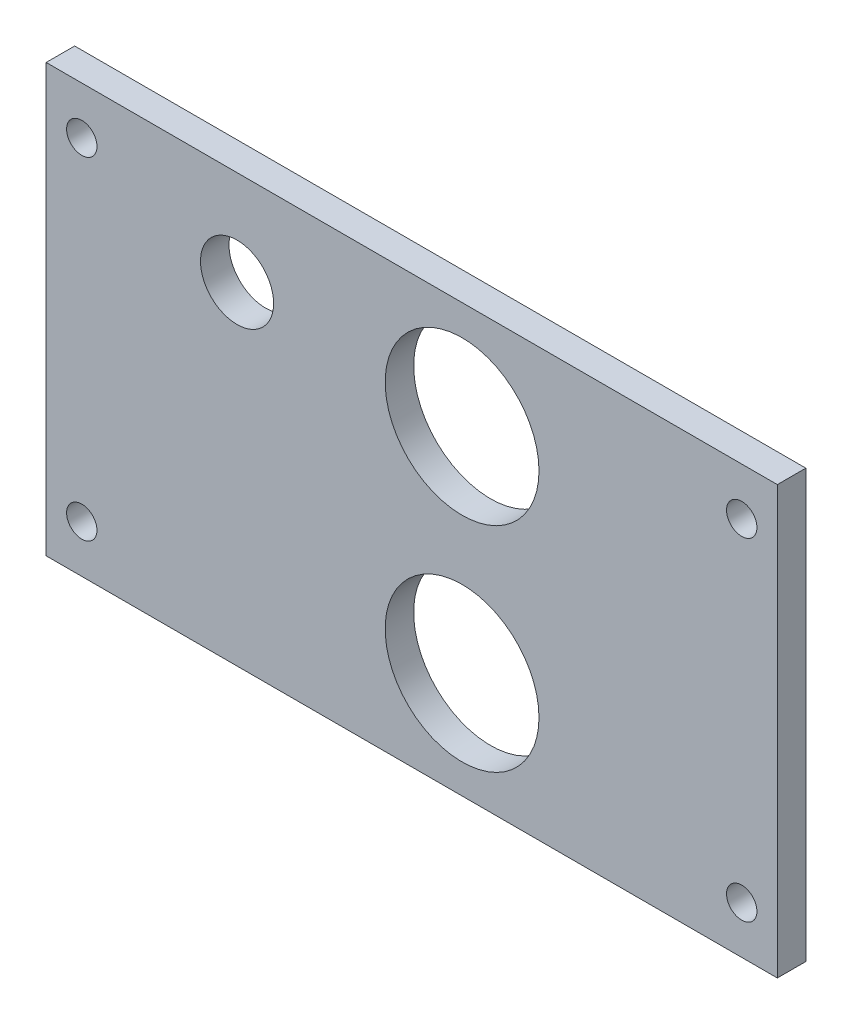
ISO-10303-21;
HEADER;
FILE_DESCRIPTION(('STEP AP214'),'2;1');
FILE_NAME('part.step','',(''),(''),'','','');
FILE_SCHEMA(('AUTOMOTIVE_DESIGN { 1 0 10303 214 1 1 1 1 }'));
ENDSEC;
DATA;
#1=APPLICATION_CONTEXT('core data for automotive mechanical design processes');
#2=APPLICATION_PROTOCOL_DEFINITION('international standard','automotive_design',2000,#1);
#3=PRODUCT_CONTEXT('',#1,'mechanical');
#4=PRODUCT('Part','Part','',(#3));
#5=PRODUCT_RELATED_PRODUCT_CATEGORY('part','',(#4));
#6=PRODUCT_DEFINITION_FORMATION('','',#4);
#7=PRODUCT_DEFINITION_CONTEXT('part definition',#1,'design');
#8=PRODUCT_DEFINITION('design','',#6,#7);
#9=PRODUCT_DEFINITION_SHAPE('','',#8);
#10=(LENGTH_UNIT() NAMED_UNIT(*) SI_UNIT(.MILLI.,.METRE.));
#11=(NAMED_UNIT(*) PLANE_ANGLE_UNIT() SI_UNIT($,.RADIAN.));
#12=(NAMED_UNIT(*) SI_UNIT($,.STERADIAN.) SOLID_ANGLE_UNIT());
#13=UNCERTAINTY_MEASURE_WITH_UNIT(LENGTH_MEASURE(1.E-05),#10,'distance_accuracy_value','');
#14=(GEOMETRIC_REPRESENTATION_CONTEXT(3) GLOBAL_UNCERTAINTY_ASSIGNED_CONTEXT((#13)) GLOBAL_UNIT_ASSIGNED_CONTEXT((#10,
#11,#12)) REPRESENTATION_CONTEXT('',''));
#15=CARTESIAN_POINT('',(0.,0.,0.));
#16=DIRECTION('',(0.,0.,1.));
#17=DIRECTION('',(1.,0.,0.));
#18=AXIS2_PLACEMENT_3D('',#15,#16,#17);
#19=CARTESIAN_POINT('',(-38.5,-22.5,3.));
#20=DIRECTION('',(1.,0.,0.));
#21=DIRECTION('',(0.,0.,-1.));
#22=AXIS2_PLACEMENT_3D('',#19,#20,#21);
#23=PLANE('',#22);
#24=DIRECTION('',(0.,-1.,0.));
#25=VECTOR('',#24,1.);
#26=CARTESIAN_POINT('',(-38.5,-22.5,0.));
#27=LINE('',#26,#25);
#28=CARTESIAN_POINT('',(-38.5,22.5,0.));
#29=VERTEX_POINT('',#28);
#30=CARTESIAN_POINT('',(-38.5,-22.5,0.));
#31=VERTEX_POINT('',#30);
#32=EDGE_CURVE('E93',#29,#31,#27,.T.);
#33=ORIENTED_EDGE('',*,*,#32,.T.);
#34=DIRECTION('',(0.,0.,-1.));
#35=VECTOR('',#34,1.);
#36=CARTESIAN_POINT('',(-38.5,-22.5,3.));
#37=LINE('',#36,#35);
#38=CARTESIAN_POINT('',(-38.5,-22.5,3.));
#39=VERTEX_POINT('',#38);
#40=EDGE_CURVE('E11',#39,#31,#37,.T.);
#41=ORIENTED_EDGE('',*,*,#40,.F.);
#42=DIRECTION('',(0.,-1.,0.));
#43=VECTOR('',#42,1.);
#44=CARTESIAN_POINT('',(-38.5,-22.5,3.));
#45=LINE('',#44,#43);
#46=CARTESIAN_POINT('',(-38.5,22.5,3.));
#47=VERTEX_POINT('',#46);
#48=EDGE_CURVE('E81',#47,#39,#45,.T.);
#49=ORIENTED_EDGE('',*,*,#48,.F.);
#50=DIRECTION('',(0.,0.,-1.));
#51=VECTOR('',#50,1.);
#52=CARTESIAN_POINT('',(-38.5,22.5,3.));
#53=LINE('',#52,#51);
#54=EDGE_CURVE('E89',#47,#29,#53,.T.);
#55=ORIENTED_EDGE('',*,*,#54,.T.);
#56=EDGE_LOOP('',(#33,#41,#49,#55));
#57=FACE_BOUND('',#56,.T.);
#58=ADVANCED_FACE('F30',(#57),#23,.F.);
#59=CARTESIAN_POINT('',(38.5,-22.5,3.));
#60=DIRECTION('',(0.,1.,0.));
#61=DIRECTION('',(-1.,0.,0.));
#62=AXIS2_PLACEMENT_3D('',#59,#60,#61);
#63=PLANE('',#62);
#64=DIRECTION('',(1.,0.,0.));
#65=VECTOR('',#64,1.);
#66=CARTESIAN_POINT('',(38.5,-22.5,0.));
#67=LINE('',#66,#65);
#68=CARTESIAN_POINT('',(38.5,-22.5,0.));
#69=VERTEX_POINT('',#68);
#70=EDGE_CURVE('E85',#31,#69,#67,.T.);
#71=ORIENTED_EDGE('',*,*,#70,.T.);
#72=DIRECTION('',(0.,0.,-1.));
#73=VECTOR('',#72,1.);
#74=CARTESIAN_POINT('',(38.5,-22.5,3.));
#75=LINE('',#74,#73);
#76=CARTESIAN_POINT('',(38.5,-22.5,3.));
#77=VERTEX_POINT('',#76);
#78=EDGE_CURVE('E38',#77,#69,#75,.T.);
#79=ORIENTED_EDGE('',*,*,#78,.F.);
#80=DIRECTION('',(1.,0.,0.));
#81=VECTOR('',#80,1.);
#82=CARTESIAN_POINT('',(38.5,-22.5,3.));
#83=LINE('',#82,#81);
#84=EDGE_CURVE('E76',#39,#77,#83,.T.);
#85=ORIENTED_EDGE('',*,*,#84,.F.);
#86=ORIENTED_EDGE('',*,*,#40,.T.);
#87=EDGE_LOOP('',(#71,#79,#85,#86));
#88=FACE_BOUND('',#87,.T.);
#89=ADVANCED_FACE('F84',(#88),#63,.F.);
#90=CARTESIAN_POINT('',(38.5,-22.5,3.));
#91=DIRECTION('',(-1.,0.,0.));
#92=DIRECTION('',(0.,0.,1.));
#93=AXIS2_PLACEMENT_3D('',#90,#91,#92);
#94=PLANE('',#93);
#95=DIRECTION('',(0.,1.,0.));
#96=VECTOR('',#95,1.);
#97=CARTESIAN_POINT('',(38.5,-22.5,0.));
#98=LINE('',#97,#96);
#99=CARTESIAN_POINT('',(38.5,22.5,0.));
#100=VERTEX_POINT('',#99);
#101=EDGE_CURVE('E63',#69,#100,#98,.T.);
#102=ORIENTED_EDGE('',*,*,#101,.T.);
#103=DIRECTION('',(0.,0.,-1.));
#104=VECTOR('',#103,1.);
#105=CARTESIAN_POINT('',(38.5,22.5,3.));
#106=LINE('',#105,#104);
#107=CARTESIAN_POINT('',(38.5,22.5,3.));
#108=VERTEX_POINT('',#107);
#109=EDGE_CURVE('E86',#108,#100,#106,.T.);
#110=ORIENTED_EDGE('',*,*,#109,.F.);
#111=DIRECTION('',(0.,1.,0.));
#112=VECTOR('',#111,1.);
#113=CARTESIAN_POINT('',(38.5,-22.5,3.));
#114=LINE('',#113,#112);
#115=EDGE_CURVE('E79',#77,#108,#114,.T.);
#116=ORIENTED_EDGE('',*,*,#115,.F.);
#117=ORIENTED_EDGE('',*,*,#78,.T.);
#118=EDGE_LOOP('',(#102,#110,#116,#117));
#119=FACE_BOUND('',#118,.T.);
#120=ADVANCED_FACE('F87',(#119),#94,.F.);
#121=CARTESIAN_POINT('',(38.5,22.5,3.));
#122=DIRECTION('',(0.,-1.,0.));
#123=DIRECTION('',(1.,0.,0.));
#124=AXIS2_PLACEMENT_3D('',#121,#122,#123);
#125=PLANE('',#124);
#126=DIRECTION('',(-1.,0.,0.));
#127=VECTOR('',#126,1.);
#128=CARTESIAN_POINT('',(38.5,22.5,0.));
#129=LINE('',#128,#127);
#130=EDGE_CURVE('E69',#100,#29,#129,.T.);
#131=ORIENTED_EDGE('',*,*,#130,.T.);
#132=ORIENTED_EDGE('',*,*,#54,.F.);
#133=DIRECTION('',(-1.,0.,0.));
#134=VECTOR('',#133,1.);
#135=CARTESIAN_POINT('',(38.5,22.5,3.));
#136=LINE('',#135,#134);
#137=EDGE_CURVE('E46',#108,#47,#136,.T.);
#138=ORIENTED_EDGE('',*,*,#137,.F.);
#139=ORIENTED_EDGE('',*,*,#109,.T.);
#140=EDGE_LOOP('',(#131,#132,#138,#139));
#141=FACE_BOUND('',#140,.T.);
#142=ADVANCED_FACE('F101',(#141),#125,.F.);
#143=CARTESIAN_POINT('',(-38.5,22.5,3.));
#144=DIRECTION('',(0.,0.,1.));
#145=DIRECTION('',(1.,0.,0.));
#146=AXIS2_PLACEMENT_3D('',#143,#144,#145);
#147=PLANE('',#146);
#148=CARTESIAN_POINT('',(-34.75,-17.5,3.));
#149=DIRECTION('',(0.,0.,1.));
#150=DIRECTION('',(1.,0.,0.));
#151=AXIS2_PLACEMENT_3D('',#148,#149,#150);
#152=CIRCLE('',#151,1.6);
#153=CARTESIAN_POINT('',(-33.15,-17.5,3.));
#154=VERTEX_POINT('',#153);
#155=EDGE_CURVE('E145',#154,#154,#152,.T.);
#156=ORIENTED_EDGE('',*,*,#155,.F.);
#157=EDGE_LOOP('',(#156));
#158=FACE_BOUND('',#157,.T.);
#159=CARTESIAN_POINT('',(34.75,-17.5,3.));
#160=DIRECTION('',(0.,0.,1.));
#161=DIRECTION('',(1.,0.,0.));
#162=AXIS2_PLACEMENT_3D('',#159,#160,#161);
#163=CIRCLE('',#162,1.6);
#164=CARTESIAN_POINT('',(36.35,-17.5,3.));
#165=VERTEX_POINT('',#164);
#166=EDGE_CURVE('E139',#165,#165,#163,.T.);
#167=ORIENTED_EDGE('',*,*,#166,.F.);
#168=EDGE_LOOP('',(#167));
#169=FACE_BOUND('',#168,.T.);
#170=CARTESIAN_POINT('',(34.75,17.5,3.));
#171=DIRECTION('',(0.,0.,1.));
#172=DIRECTION('',(1.,0.,0.));
#173=AXIS2_PLACEMENT_3D('',#170,#171,#172);
#174=CIRCLE('',#173,1.6);
#175=CARTESIAN_POINT('',(36.35,17.5,3.));
#176=VERTEX_POINT('',#175);
#177=EDGE_CURVE('E133',#176,#176,#174,.T.);
#178=ORIENTED_EDGE('',*,*,#177,.F.);
#179=EDGE_LOOP('',(#178));
#180=FACE_BOUND('',#179,.T.);
#181=CARTESIAN_POINT('',(-34.75,17.5,3.));
#182=DIRECTION('',(0.,0.,1.));
#183=DIRECTION('',(1.,0.,0.));
#184=AXIS2_PLACEMENT_3D('',#181,#182,#183);
#185=CIRCLE('',#184,1.6);
#186=CARTESIAN_POINT('',(-33.15,17.5,3.));
#187=VERTEX_POINT('',#186);
#188=EDGE_CURVE('E127',#187,#187,#185,.T.);
#189=ORIENTED_EDGE('',*,*,#188,.F.);
#190=EDGE_LOOP('',(#189));
#191=FACE_BOUND('',#190,.T.);
#192=CARTESIAN_POINT('',(-18.4,12.5,3.));
#193=DIRECTION('',(0.,0.,1.));
#194=DIRECTION('',(1.,0.,0.));
#195=AXIS2_PLACEMENT_3D('',#192,#193,#194);
#196=CIRCLE('',#195,3.85);
#197=CARTESIAN_POINT('',(-14.55,12.5,3.));
#198=VERTEX_POINT('',#197);
#199=EDGE_CURVE('E121',#198,#198,#196,.T.);
#200=ORIENTED_EDGE('',*,*,#199,.F.);
#201=EDGE_LOOP('',(#200));
#202=FACE_BOUND('',#201,.T.);
#203=CARTESIAN_POINT('',(5.29999999999999,-11.3,3.));
#204=DIRECTION('',(0.,0.,1.));
#205=DIRECTION('',(1.,0.,0.));
#206=AXIS2_PLACEMENT_3D('',#203,#204,#205);
#207=CIRCLE('',#206,8.1);
#208=CARTESIAN_POINT('',(13.4,-11.3,3.));
#209=VERTEX_POINT('',#208);
#210=EDGE_CURVE('E115',#209,#209,#207,.T.);
#211=ORIENTED_EDGE('',*,*,#210,.F.);
#212=EDGE_LOOP('',(#211));
#213=FACE_BOUND('',#212,.T.);
#214=CARTESIAN_POINT('',(5.29999999999999,11.2,3.));
#215=DIRECTION('',(0.,0.,1.));
#216=DIRECTION('',(1.,0.,0.));
#217=AXIS2_PLACEMENT_3D('',#214,#215,#216);
#218=CIRCLE('',#217,8.1);
#219=CARTESIAN_POINT('',(13.4,11.2,3.));
#220=VERTEX_POINT('',#219);
#221=EDGE_CURVE('E109',#220,#220,#218,.T.);
#222=ORIENTED_EDGE('',*,*,#221,.F.);
#223=EDGE_LOOP('',(#222));
#224=FACE_BOUND('',#223,.T.);
#225=ORIENTED_EDGE('',*,*,#48,.T.);
#226=ORIENTED_EDGE('',*,*,#84,.T.);
#227=ORIENTED_EDGE('',*,*,#115,.T.);
#228=ORIENTED_EDGE('',*,*,#137,.T.);
#229=EDGE_LOOP('',(#225,#226,#227,#228));
#230=FACE_BOUND('',#229,.T.);
#231=ADVANCED_FACE('F77',(#158,#169,#180,#191,#202,#213,#224,#230),#147,.T.);
#232=CARTESIAN_POINT('',(-38.5,22.5,0.));
#233=DIRECTION('',(0.,0.,1.));
#234=DIRECTION('',(1.,0.,0.));
#235=AXIS2_PLACEMENT_3D('',#232,#233,#234);
#236=PLANE('',#235);
#237=CARTESIAN_POINT('',(-34.75,-17.5,0.));
#238=DIRECTION('',(0.,0.,1.));
#239=DIRECTION('',(1.,0.,0.));
#240=AXIS2_PLACEMENT_3D('',#237,#238,#239);
#241=CIRCLE('',#240,1.6);
#242=CARTESIAN_POINT('',(-33.15,-17.5,0.));
#243=VERTEX_POINT('',#242);
#244=EDGE_CURVE('E142',#243,#243,#241,.F.);
#245=ORIENTED_EDGE('',*,*,#244,.F.);
#246=EDGE_LOOP('',(#245));
#247=FACE_BOUND('',#246,.T.);
#248=CARTESIAN_POINT('',(34.75,-17.5,0.));
#249=DIRECTION('',(0.,0.,1.));
#250=DIRECTION('',(1.,0.,0.));
#251=AXIS2_PLACEMENT_3D('',#248,#249,#250);
#252=CIRCLE('',#251,1.6);
#253=CARTESIAN_POINT('',(36.35,-17.5,0.));
#254=VERTEX_POINT('',#253);
#255=EDGE_CURVE('E136',#254,#254,#252,.F.);
#256=ORIENTED_EDGE('',*,*,#255,.F.);
#257=EDGE_LOOP('',(#256));
#258=FACE_BOUND('',#257,.T.);
#259=CARTESIAN_POINT('',(34.75,17.5,0.));
#260=DIRECTION('',(0.,0.,1.));
#261=DIRECTION('',(1.,0.,0.));
#262=AXIS2_PLACEMENT_3D('',#259,#260,#261);
#263=CIRCLE('',#262,1.6);
#264=CARTESIAN_POINT('',(36.35,17.5,0.));
#265=VERTEX_POINT('',#264);
#266=EDGE_CURVE('E130',#265,#265,#263,.F.);
#267=ORIENTED_EDGE('',*,*,#266,.F.);
#268=EDGE_LOOP('',(#267));
#269=FACE_BOUND('',#268,.T.);
#270=CARTESIAN_POINT('',(-34.75,17.5,0.));
#271=DIRECTION('',(0.,0.,1.));
#272=DIRECTION('',(1.,0.,0.));
#273=AXIS2_PLACEMENT_3D('',#270,#271,#272);
#274=CIRCLE('',#273,1.6);
#275=CARTESIAN_POINT('',(-33.15,17.5,0.));
#276=VERTEX_POINT('',#275);
#277=EDGE_CURVE('E124',#276,#276,#274,.F.);
#278=ORIENTED_EDGE('',*,*,#277,.F.);
#279=EDGE_LOOP('',(#278));
#280=FACE_BOUND('',#279,.T.);
#281=CARTESIAN_POINT('',(-18.4,12.5,0.));
#282=DIRECTION('',(0.,0.,1.));
#283=DIRECTION('',(1.,0.,0.));
#284=AXIS2_PLACEMENT_3D('',#281,#282,#283);
#285=CIRCLE('',#284,3.85);
#286=CARTESIAN_POINT('',(-14.55,12.5,0.));
#287=VERTEX_POINT('',#286);
#288=EDGE_CURVE('E118',#287,#287,#285,.F.);
#289=ORIENTED_EDGE('',*,*,#288,.F.);
#290=EDGE_LOOP('',(#289));
#291=FACE_BOUND('',#290,.T.);
#292=CARTESIAN_POINT('',(5.29999999999999,-11.3,0.));
#293=DIRECTION('',(0.,0.,1.));
#294=DIRECTION('',(1.,0.,0.));
#295=AXIS2_PLACEMENT_3D('',#292,#293,#294);
#296=CIRCLE('',#295,8.1);
#297=CARTESIAN_POINT('',(13.4,-11.3,0.));
#298=VERTEX_POINT('',#297);
#299=EDGE_CURVE('E112',#298,#298,#296,.F.);
#300=ORIENTED_EDGE('',*,*,#299,.F.);
#301=EDGE_LOOP('',(#300));
#302=FACE_BOUND('',#301,.T.);
#303=CARTESIAN_POINT('',(5.29999999999999,11.2,0.));
#304=DIRECTION('',(0.,0.,1.));
#305=DIRECTION('',(1.,0.,0.));
#306=AXIS2_PLACEMENT_3D('',#303,#304,#305);
#307=CIRCLE('',#306,8.1);
#308=CARTESIAN_POINT('',(13.4,11.2,0.));
#309=VERTEX_POINT('',#308);
#310=EDGE_CURVE('E96',#309,#309,#307,.F.);
#311=ORIENTED_EDGE('',*,*,#310,.F.);
#312=EDGE_LOOP('',(#311));
#313=FACE_BOUND('',#312,.T.);
#314=ORIENTED_EDGE('',*,*,#32,.F.);
#315=ORIENTED_EDGE('',*,*,#130,.F.);
#316=ORIENTED_EDGE('',*,*,#101,.F.);
#317=ORIENTED_EDGE('',*,*,#70,.F.);
#318=EDGE_LOOP('',(#314,#315,#316,#317));
#319=FACE_BOUND('',#318,.T.);
#320=ADVANCED_FACE('F104',(#247,#258,#269,#280,#291,#302,#313,#319),#236,.F.);
#321=CARTESIAN_POINT('',(5.29999999999999,11.2,-0.00100000000000013));
#322=DIRECTION('',(0.,0.,1.));
#323=DIRECTION('',(1.,0.,0.));
#324=AXIS2_PLACEMENT_3D('',#321,#322,#323);
#325=CYLINDRICAL_SURFACE('',#324,8.1);
#326=ORIENTED_EDGE('',*,*,#221,.T.);
#327=EDGE_LOOP('',(#326));
#328=FACE_BOUND('',#327,.T.);
#329=ORIENTED_EDGE('',*,*,#310,.T.);
#330=EDGE_LOOP('',(#329));
#331=FACE_BOUND('',#330,.T.);
#332=ADVANCED_FACE('F167',(#328,#331),#325,.F.);
#333=CARTESIAN_POINT('',(5.29999999999999,-11.3,-0.00100000000000013));
#334=DIRECTION('',(0.,0.,1.));
#335=DIRECTION('',(1.,0.,0.));
#336=AXIS2_PLACEMENT_3D('',#333,#334,#335);
#337=CYLINDRICAL_SURFACE('',#336,8.1);
#338=ORIENTED_EDGE('',*,*,#210,.T.);
#339=EDGE_LOOP('',(#338));
#340=FACE_BOUND('',#339,.T.);
#341=ORIENTED_EDGE('',*,*,#299,.T.);
#342=EDGE_LOOP('',(#341));
#343=FACE_BOUND('',#342,.T.);
#344=ADVANCED_FACE('F170',(#340,#343),#337,.F.);
#345=CARTESIAN_POINT('',(-18.4,12.5,-0.00100000000000013));
#346=DIRECTION('',(0.,0.,1.));
#347=DIRECTION('',(1.,0.,0.));
#348=AXIS2_PLACEMENT_3D('',#345,#346,#347);
#349=CYLINDRICAL_SURFACE('',#348,3.85);
#350=ORIENTED_EDGE('',*,*,#199,.T.);
#351=EDGE_LOOP('',(#350));
#352=FACE_BOUND('',#351,.T.);
#353=ORIENTED_EDGE('',*,*,#288,.T.);
#354=EDGE_LOOP('',(#353));
#355=FACE_BOUND('',#354,.T.);
#356=ADVANCED_FACE('F215',(#352,#355),#349,.F.);
#357=CARTESIAN_POINT('',(-34.75,17.5,-0.00100000000000013));
#358=DIRECTION('',(0.,0.,1.));
#359=DIRECTION('',(1.,0.,0.));
#360=AXIS2_PLACEMENT_3D('',#357,#358,#359);
#361=CYLINDRICAL_SURFACE('',#360,1.6);
#362=ORIENTED_EDGE('',*,*,#188,.T.);
#363=EDGE_LOOP('',(#362));
#364=FACE_BOUND('',#363,.T.);
#365=ORIENTED_EDGE('',*,*,#277,.T.);
#366=EDGE_LOOP('',(#365));
#367=FACE_BOUND('',#366,.T.);
#368=ADVANCED_FACE('F223',(#364,#367),#361,.F.);
#369=CARTESIAN_POINT('',(34.75,17.5,-0.00100000000000013));
#370=DIRECTION('',(0.,0.,1.));
#371=DIRECTION('',(1.,0.,0.));
#372=AXIS2_PLACEMENT_3D('',#369,#370,#371);
#373=CYLINDRICAL_SURFACE('',#372,1.6);
#374=ORIENTED_EDGE('',*,*,#177,.T.);
#375=EDGE_LOOP('',(#374));
#376=FACE_BOUND('',#375,.T.);
#377=ORIENTED_EDGE('',*,*,#266,.T.);
#378=EDGE_LOOP('',(#377));
#379=FACE_BOUND('',#378,.T.);
#380=ADVANCED_FACE('F231',(#376,#379),#373,.F.);
#381=CARTESIAN_POINT('',(34.75,-17.5,-0.00100000000000013));
#382=DIRECTION('',(0.,0.,1.));
#383=DIRECTION('',(1.,0.,0.));
#384=AXIS2_PLACEMENT_3D('',#381,#382,#383);
#385=CYLINDRICAL_SURFACE('',#384,1.6);
#386=ORIENTED_EDGE('',*,*,#166,.T.);
#387=EDGE_LOOP('',(#386));
#388=FACE_BOUND('',#387,.T.);
#389=ORIENTED_EDGE('',*,*,#255,.T.);
#390=EDGE_LOOP('',(#389));
#391=FACE_BOUND('',#390,.T.);
#392=ADVANCED_FACE('F239',(#388,#391),#385,.F.);
#393=CARTESIAN_POINT('',(-34.75,-17.5,-0.00100000000000013));
#394=DIRECTION('',(0.,0.,1.));
#395=DIRECTION('',(1.,0.,0.));
#396=AXIS2_PLACEMENT_3D('',#393,#394,#395);
#397=CYLINDRICAL_SURFACE('',#396,1.6);
#398=ORIENTED_EDGE('',*,*,#155,.T.);
#399=EDGE_LOOP('',(#398));
#400=FACE_BOUND('',#399,.T.);
#401=ORIENTED_EDGE('',*,*,#244,.T.);
#402=EDGE_LOOP('',(#401));
#403=FACE_BOUND('',#402,.T.);
#404=ADVANCED_FACE('F149',(#400,#403),#397,.F.);
#405=CLOSED_SHELL('',(#58,#89,#120,#142,#231,#320,#332,#344,#356,#368,#380,#392,#404));
#406=MANIFOLD_SOLID_BREP('B2',#405);
#407=ADVANCED_BREP_SHAPE_REPRESENTATION('',(#18,#406),#14);
#408=SHAPE_DEFINITION_REPRESENTATION(#9,#407);
ENDSEC;
END-ISO-10303-21;
